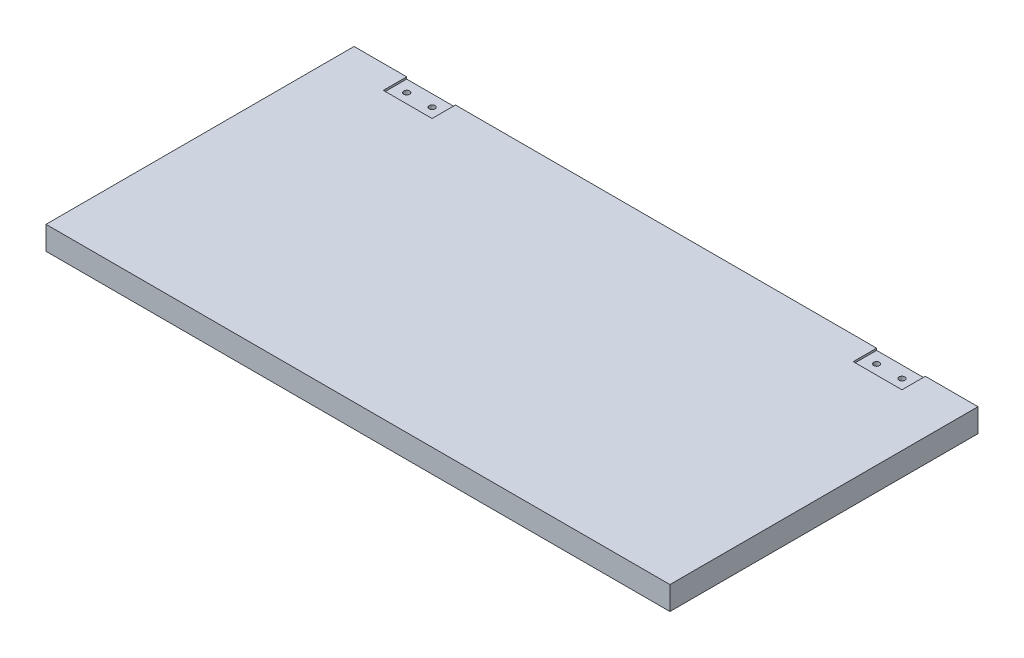
ISO-10303-21;
HEADER;
FILE_DESCRIPTION(('STEP AP214'),'2;1');
FILE_NAME('part.step','',(''),(''),'','','');
FILE_SCHEMA(('AUTOMOTIVE_DESIGN { 1 0 10303 214 1 1 1 1 }'));
ENDSEC;
DATA;
#1=APPLICATION_CONTEXT('core data for automotive mechanical design processes');
#2=APPLICATION_PROTOCOL_DEFINITION('international standard','automotive_design',2000,#1);
#3=PRODUCT_CONTEXT('',#1,'mechanical');
#4=PRODUCT('Part','Part','',(#3));
#5=PRODUCT_RELATED_PRODUCT_CATEGORY('part','',(#4));
#6=PRODUCT_DEFINITION_FORMATION('','',#4);
#7=PRODUCT_DEFINITION_CONTEXT('part definition',#1,'design');
#8=PRODUCT_DEFINITION('design','',#6,#7);
#9=PRODUCT_DEFINITION_SHAPE('','',#8);
#10=(LENGTH_UNIT() NAMED_UNIT(*) SI_UNIT(.MILLI.,.METRE.));
#11=(NAMED_UNIT(*) PLANE_ANGLE_UNIT() SI_UNIT($,.RADIAN.));
#12=(NAMED_UNIT(*) SI_UNIT($,.STERADIAN.) SOLID_ANGLE_UNIT());
#13=UNCERTAINTY_MEASURE_WITH_UNIT(LENGTH_MEASURE(1.E-05),#10,'distance_accuracy_value','');
#14=(GEOMETRIC_REPRESENTATION_CONTEXT(3) GLOBAL_UNCERTAINTY_ASSIGNED_CONTEXT((#13)) GLOBAL_UNIT_ASSIGNED_CONTEXT((#10,
#11,#12)) REPRESENTATION_CONTEXT('',''));
#15=CARTESIAN_POINT('',(0.,0.,0.));
#16=DIRECTION('',(0.,0.,1.));
#17=DIRECTION('',(1.,0.,0.));
#18=AXIS2_PLACEMENT_3D('',#15,#16,#17);
#19=CARTESIAN_POINT('',(0.,12.,0.));
#20=DIRECTION('',(1.,0.,0.));
#21=DIRECTION('',(0.,0.,-1.));
#22=AXIS2_PLACEMENT_3D('',#19,#20,#21);
#23=PLANE('',#22);
#24=DIRECTION('',(0.,0.,1.));
#25=VECTOR('',#24,1.);
#26=CARTESIAN_POINT('',(0.,0.,0.));
#27=LINE('',#26,#25);
#28=CARTESIAN_POINT('',(0.,0.,-158.));
#29=VERTEX_POINT('',#28);
#30=CARTESIAN_POINT('',(0.,0.,0.));
#31=VERTEX_POINT('',#30);
#32=EDGE_CURVE('E174',#29,#31,#27,.T.);
#33=ORIENTED_EDGE('',*,*,#32,.T.);
#34=DIRECTION('',(0.,-1.,0.));
#35=VECTOR('',#34,1.);
#36=CARTESIAN_POINT('',(0.,12.,0.));
#37=LINE('',#36,#35);
#38=CARTESIAN_POINT('',(0.,12.,0.));
#39=VERTEX_POINT('',#38);
#40=EDGE_CURVE('E11',#39,#31,#37,.T.);
#41=ORIENTED_EDGE('',*,*,#40,.F.);
#42=DIRECTION('',(0.,0.,1.));
#43=VECTOR('',#42,1.);
#44=CARTESIAN_POINT('',(0.,12.,0.));
#45=LINE('',#44,#43);
#46=CARTESIAN_POINT('',(0.,12.,-158.));
#47=VERTEX_POINT('',#46);
#48=EDGE_CURVE('E180',#47,#39,#45,.T.);
#49=ORIENTED_EDGE('',*,*,#48,.F.);
#50=DIRECTION('',(0.,-1.,0.));
#51=VECTOR('',#50,1.);
#52=CARTESIAN_POINT('',(0.,12.,-158.));
#53=LINE('',#52,#51);
#54=EDGE_CURVE('E192',#47,#29,#53,.T.);
#55=ORIENTED_EDGE('',*,*,#54,.T.);
#56=EDGE_LOOP('',(#33,#41,#49,#55));
#57=FACE_BOUND('',#56,.T.);
#58=ADVANCED_FACE('F32',(#57),#23,.F.);
#59=CARTESIAN_POINT('',(0.,12.,0.));
#60=DIRECTION('',(0.,0.,-1.));
#61=DIRECTION('',(-1.,0.,0.));
#62=AXIS2_PLACEMENT_3D('',#59,#60,#61);
#63=PLANE('',#62);
#64=DIRECTION('',(1.,0.,0.));
#65=VECTOR('',#64,1.);
#66=CARTESIAN_POINT('',(0.,0.,0.));
#67=LINE('',#66,#65);
#68=CARTESIAN_POINT('',(320.,0.,0.));
#69=VERTEX_POINT('',#68);
#70=EDGE_CURVE('E195',#31,#69,#67,.T.);
#71=ORIENTED_EDGE('',*,*,#70,.T.);
#72=DIRECTION('',(0.,-1.,0.));
#73=VECTOR('',#72,1.);
#74=CARTESIAN_POINT('',(320.,12.,0.));
#75=LINE('',#74,#73);
#76=CARTESIAN_POINT('',(320.,12.,0.));
#77=VERTEX_POINT('',#76);
#78=EDGE_CURVE('E40',#77,#69,#75,.T.);
#79=ORIENTED_EDGE('',*,*,#78,.F.);
#80=DIRECTION('',(1.,0.,0.));
#81=VECTOR('',#80,1.);
#82=CARTESIAN_POINT('',(0.,12.,0.));
#83=LINE('',#82,#81);
#84=EDGE_CURVE('E183',#39,#77,#83,.T.);
#85=ORIENTED_EDGE('',*,*,#84,.F.);
#86=ORIENTED_EDGE('',*,*,#40,.T.);
#87=EDGE_LOOP('',(#71,#79,#85,#86));
#88=FACE_BOUND('',#87,.T.);
#89=ADVANCED_FACE('F280',(#88),#63,.F.);
#90=CARTESIAN_POINT('',(320.,12.,0.));
#91=DIRECTION('',(-1.,0.,0.));
#92=DIRECTION('',(0.,0.,1.));
#93=AXIS2_PLACEMENT_3D('',#90,#91,#92);
#94=PLANE('',#93);
#95=DIRECTION('',(0.,0.,-1.));
#96=VECTOR('',#95,1.);
#97=CARTESIAN_POINT('',(320.,0.,0.));
#98=LINE('',#97,#96);
#99=CARTESIAN_POINT('',(320.,0.,-158.));
#100=VERTEX_POINT('',#99);
#101=EDGE_CURVE('E197',#69,#100,#98,.T.);
#102=ORIENTED_EDGE('',*,*,#101,.T.);
#103=DIRECTION('',(0.,-1.,0.));
#104=VECTOR('',#103,1.);
#105=CARTESIAN_POINT('',(320.,12.,-158.));
#106=LINE('',#105,#104);
#107=CARTESIAN_POINT('',(320.,12.,-158.));
#108=VERTEX_POINT('',#107);
#109=EDGE_CURVE('E202',#108,#100,#106,.T.);
#110=ORIENTED_EDGE('',*,*,#109,.F.);
#111=DIRECTION('',(0.,0.,-1.));
#112=VECTOR('',#111,1.);
#113=CARTESIAN_POINT('',(320.,12.,0.));
#114=LINE('',#113,#112);
#115=EDGE_CURVE('E186',#77,#108,#114,.T.);
#116=ORIENTED_EDGE('',*,*,#115,.F.);
#117=ORIENTED_EDGE('',*,*,#78,.T.);
#118=EDGE_LOOP('',(#102,#110,#116,#117));
#119=FACE_BOUND('',#118,.T.);
#120=ADVANCED_FACE('F284',(#119),#94,.F.);
#121=CARTESIAN_POINT('',(0.,12.,-158.));
#122=DIRECTION('',(0.,0.,1.));
#123=DIRECTION('',(1.,0.,0.));
#124=AXIS2_PLACEMENT_3D('',#121,#122,#123);
#125=PLANE('',#124);
#126=DIRECTION('',(-1.,0.,0.));
#127=VECTOR('',#126,1.);
#128=CARTESIAN_POINT('',(0.,11.,-157.999999999997));
#129=LINE('',#128,#127);
#130=CARTESIAN_POINT('',(293.,11.,-157.999999999997));
#131=VERTEX_POINT('',#130);
#132=CARTESIAN_POINT('',(268.,11.,-157.999999999997));
#133=VERTEX_POINT('',#132);
#134=EDGE_CURVE('E130',#131,#133,#129,.T.);
#135=ORIENTED_EDGE('',*,*,#134,.F.);
#136=DIRECTION('',(0.,1.,0.));
#137=VECTOR('',#136,1.);
#138=CARTESIAN_POINT('',(293.,11.,-157.999999999997));
#139=LINE('',#138,#137);
#140=CARTESIAN_POINT('',(293.,12.,-157.999999999997));
#141=VERTEX_POINT('',#140);
#142=EDGE_CURVE('E167',#131,#141,#139,.T.);
#143=ORIENTED_EDGE('',*,*,#142,.T.);
#144=DIRECTION('',(-1.,0.,0.));
#145=VECTOR('',#144,1.);
#146=CARTESIAN_POINT('',(0.,12.,-158.));
#147=LINE('',#146,#145);
#148=EDGE_CURVE('E189',#108,#141,#147,.T.);
#149=ORIENTED_EDGE('',*,*,#148,.F.);
#150=ORIENTED_EDGE('',*,*,#109,.T.);
#151=DIRECTION('',(-1.,0.,0.));
#152=VECTOR('',#151,1.);
#153=CARTESIAN_POINT('',(0.,0.,-158.));
#154=LINE('',#153,#152);
#155=EDGE_CURVE('E184',#100,#29,#154,.T.);
#156=ORIENTED_EDGE('',*,*,#155,.T.);
#157=ORIENTED_EDGE('',*,*,#54,.F.);
#158=CARTESIAN_POINT('',(27.,12.,-158.));
#159=VERTEX_POINT('',#158);
#160=EDGE_CURVE('E188',#159,#47,#147,.T.);
#161=ORIENTED_EDGE('',*,*,#160,.F.);
#162=DIRECTION('',(0.,1.,0.));
#163=VECTOR('',#162,1.);
#164=CARTESIAN_POINT('',(27.,11.,-157.999999999997));
#165=LINE('',#164,#163);
#166=CARTESIAN_POINT('',(27.,11.,-157.999999999997));
#167=VERTEX_POINT('',#166);
#168=EDGE_CURVE('E56',#167,#159,#165,.T.);
#169=ORIENTED_EDGE('',*,*,#168,.F.);
#170=DIRECTION('',(-1.,0.,0.));
#171=VECTOR('',#170,1.);
#172=CARTESIAN_POINT('',(-1.75415237890771E-13,11.,-157.999999999997));
#173=LINE('',#172,#171);
#174=CARTESIAN_POINT('',(52.,11.,-157.999999999997));
#175=VERTEX_POINT('',#174);
#176=EDGE_CURVE('E151',#175,#167,#173,.T.);
#177=ORIENTED_EDGE('',*,*,#176,.F.);
#178=DIRECTION('',(0.,1.,0.));
#179=VECTOR('',#178,1.);
#180=CARTESIAN_POINT('',(52.,11.,-157.999999999997));
#181=LINE('',#180,#179);
#182=CARTESIAN_POINT('',(52.,12.,-157.999999999997));
#183=VERTEX_POINT('',#182);
#184=EDGE_CURVE('E172',#175,#183,#181,.T.);
#185=ORIENTED_EDGE('',*,*,#184,.T.);
#186=CARTESIAN_POINT('',(268.,12.,-158.));
#187=VERTEX_POINT('',#186);
#188=EDGE_CURVE('E144',#187,#183,#147,.T.);
#189=ORIENTED_EDGE('',*,*,#188,.F.);
#190=DIRECTION('',(0.,1.,0.));
#191=VECTOR('',#190,1.);
#192=CARTESIAN_POINT('',(268.,11.,-157.999999999997));
#193=LINE('',#192,#191);
#194=EDGE_CURVE('E48',#133,#187,#193,.T.);
#195=ORIENTED_EDGE('',*,*,#194,.F.);
#196=EDGE_LOOP('',(#135,#143,#149,#150,#156,#157,#161,#169,#177,#185,#189,#195));
#197=FACE_BOUND('',#196,.T.);
#198=ADVANCED_FACE('F142',(#197),#125,.F.);
#199=CARTESIAN_POINT('',(0.,12.,0.));
#200=DIRECTION('',(0.,-1.,0.));
#201=DIRECTION('',(0.,0.,-1.));
#202=AXIS2_PLACEMENT_3D('',#199,#200,#201);
#203=PLANE('',#202);
#204=ORIENTED_EDGE('',*,*,#148,.T.);
#205=DIRECTION('',(0.,0.,-1.));
#206=VECTOR('',#205,1.);
#207=CARTESIAN_POINT('',(293.,12.,0.));
#208=LINE('',#207,#206);
#209=CARTESIAN_POINT('',(293.,12.,-145.999999999997));
#210=VERTEX_POINT('',#209);
#211=EDGE_CURVE('E139',#210,#141,#208,.T.);
#212=ORIENTED_EDGE('',*,*,#211,.F.);
#213=DIRECTION('',(1.,0.,0.));
#214=VECTOR('',#213,1.);
#215=CARTESIAN_POINT('',(0.,12.,-145.999999999997));
#216=LINE('',#215,#214);
#217=CARTESIAN_POINT('',(268.,12.,-145.999999999997));
#218=VERTEX_POINT('',#217);
#219=EDGE_CURVE('E232',#218,#210,#216,.T.);
#220=ORIENTED_EDGE('',*,*,#219,.F.);
#221=DIRECTION('',(0.,0.,1.));
#222=VECTOR('',#221,1.);
#223=CARTESIAN_POINT('',(268.,12.,0.));
#224=LINE('',#223,#222);
#225=EDGE_CURVE('E210',#187,#218,#224,.T.);
#226=ORIENTED_EDGE('',*,*,#225,.F.);
#227=ORIENTED_EDGE('',*,*,#188,.T.);
#228=DIRECTION('',(0.,0.,-1.));
#229=VECTOR('',#228,1.);
#230=CARTESIAN_POINT('',(52.,12.,0.));
#231=LINE('',#230,#229);
#232=CARTESIAN_POINT('',(52.,12.,-145.999999999997));
#233=VERTEX_POINT('',#232);
#234=EDGE_CURVE('E155',#233,#183,#231,.T.);
#235=ORIENTED_EDGE('',*,*,#234,.F.);
#236=DIRECTION('',(1.,0.,0.));
#237=VECTOR('',#236,1.);
#238=CARTESIAN_POINT('',(0.,12.,-145.999999999997));
#239=LINE('',#238,#237);
#240=CARTESIAN_POINT('',(27.,12.,-145.999999999997));
#241=VERTEX_POINT('',#240);
#242=EDGE_CURVE('E166',#241,#233,#239,.T.);
#243=ORIENTED_EDGE('',*,*,#242,.F.);
#244=DIRECTION('',(0.,0.,1.));
#245=VECTOR('',#244,1.);
#246=CARTESIAN_POINT('',(27.,12.,0.));
#247=LINE('',#246,#245);
#248=EDGE_CURVE('E164',#159,#241,#247,.T.);
#249=ORIENTED_EDGE('',*,*,#248,.F.);
#250=ORIENTED_EDGE('',*,*,#160,.T.);
#251=ORIENTED_EDGE('',*,*,#48,.T.);
#252=ORIENTED_EDGE('',*,*,#84,.T.);
#253=ORIENTED_EDGE('',*,*,#115,.T.);
#254=EDGE_LOOP('',(#204,#212,#220,#226,#227,#235,#243,#249,#250,#251,#252,#253));
#255=FACE_BOUND('',#254,.T.);
#256=ADVANCED_FACE('F243',(#255),#203,.F.);
#257=CARTESIAN_POINT('',(0.,0.,0.));
#258=DIRECTION('',(0.,-1.,0.));
#259=DIRECTION('',(0.,0.,-1.));
#260=AXIS2_PLACEMENT_3D('',#257,#258,#259);
#261=PLANE('',#260);
#262=ORIENTED_EDGE('',*,*,#32,.F.);
#263=ORIENTED_EDGE('',*,*,#155,.F.);
#264=ORIENTED_EDGE('',*,*,#101,.F.);
#265=ORIENTED_EDGE('',*,*,#70,.F.);
#266=EDGE_LOOP('',(#262,#263,#264,#265));
#267=FACE_BOUND('',#266,.T.);
#268=ADVANCED_FACE('F253',(#267),#261,.T.);
#269=CARTESIAN_POINT('',(52.,11.,0.));
#270=DIRECTION('',(1.,0.,0.));
#271=DIRECTION('',(0.,0.,-1.));
#272=AXIS2_PLACEMENT_3D('',#269,#270,#271);
#273=PLANE('',#272);
#274=ORIENTED_EDGE('',*,*,#234,.T.);
#275=ORIENTED_EDGE('',*,*,#184,.F.);
#276=DIRECTION('',(0.,0.,-1.));
#277=VECTOR('',#276,1.);
#278=CARTESIAN_POINT('',(52.,11.,0.));
#279=LINE('',#278,#277);
#280=CARTESIAN_POINT('',(52.,11.,-145.999999999997));
#281=VERTEX_POINT('',#280);
#282=EDGE_CURVE('E161',#281,#175,#279,.T.);
#283=ORIENTED_EDGE('',*,*,#282,.F.);
#284=DIRECTION('',(0.,1.,0.));
#285=VECTOR('',#284,1.);
#286=CARTESIAN_POINT('',(52.,11.,-145.999999999997));
#287=LINE('',#286,#285);
#288=EDGE_CURVE('E175',#281,#233,#287,.T.);
#289=ORIENTED_EDGE('',*,*,#288,.T.);
#290=EDGE_LOOP('',(#274,#275,#283,#289));
#291=FACE_BOUND('',#290,.T.);
#292=ADVANCED_FACE('F262',(#291),#273,.F.);
#293=CARTESIAN_POINT('',(0.,11.,-145.999999999997));
#294=DIRECTION('',(0.,0.,1.));
#295=DIRECTION('',(1.,0.,0.));
#296=AXIS2_PLACEMENT_3D('',#293,#294,#295);
#297=PLANE('',#296);
#298=ORIENTED_EDGE('',*,*,#242,.T.);
#299=ORIENTED_EDGE('',*,*,#288,.F.);
#300=DIRECTION('',(1.,0.,0.));
#301=VECTOR('',#300,1.);
#302=CARTESIAN_POINT('',(0.,11.,-145.999999999997));
#303=LINE('',#302,#301);
#304=CARTESIAN_POINT('',(27.,11.,-145.999999999997));
#305=VERTEX_POINT('',#304);
#306=EDGE_CURVE('E158',#305,#281,#303,.T.);
#307=ORIENTED_EDGE('',*,*,#306,.F.);
#308=DIRECTION('',(0.,1.,0.));
#309=VECTOR('',#308,1.);
#310=CARTESIAN_POINT('',(27.,11.,-145.999999999997));
#311=LINE('',#310,#309);
#312=EDGE_CURVE('E177',#305,#241,#311,.T.);
#313=ORIENTED_EDGE('',*,*,#312,.T.);
#314=EDGE_LOOP('',(#298,#299,#307,#313));
#315=FACE_BOUND('',#314,.T.);
#316=ADVANCED_FACE('F268',(#315),#297,.F.);
#317=CARTESIAN_POINT('',(27.,11.,0.));
#318=DIRECTION('',(-1.,0.,0.));
#319=DIRECTION('',(0.,0.,1.));
#320=AXIS2_PLACEMENT_3D('',#317,#318,#319);
#321=PLANE('',#320);
#322=ORIENTED_EDGE('',*,*,#248,.T.);
#323=ORIENTED_EDGE('',*,*,#312,.F.);
#324=DIRECTION('',(0.,0.,1.));
#325=VECTOR('',#324,1.);
#326=CARTESIAN_POINT('',(27.,11.,0.));
#327=LINE('',#326,#325);
#328=EDGE_CURVE('E154',#167,#305,#327,.T.);
#329=ORIENTED_EDGE('',*,*,#328,.F.);
#330=ORIENTED_EDGE('',*,*,#168,.T.);
#331=EDGE_LOOP('',(#322,#323,#329,#330));
#332=FACE_BOUND('',#331,.T.);
#333=ADVANCED_FACE('F269',(#332),#321,.F.);
#334=CARTESIAN_POINT('',(0.,11.,0.));
#335=DIRECTION('',(0.,1.,0.));
#336=DIRECTION('',(0.,0.,1.));
#337=AXIS2_PLACEMENT_3D('',#334,#335,#336);
#338=PLANE('',#337);
#339=CARTESIAN_POINT('',(46.,11.,-152.));
#340=DIRECTION('',(0.,1.,0.));
#341=DIRECTION('',(0.,0.,1.));
#342=AXIS2_PLACEMENT_3D('',#339,#340,#341);
#343=CIRCLE('',#342,1.5);
#344=CARTESIAN_POINT('',(46.,11.,-150.5));
#345=VERTEX_POINT('',#344);
#346=EDGE_CURVE('E35',#345,#345,#343,.F.);
#347=ORIENTED_EDGE('',*,*,#346,.T.);
#348=EDGE_LOOP('',(#347));
#349=FACE_BOUND('',#348,.T.);
#350=CARTESIAN_POINT('',(33.,11.,-152.));
#351=DIRECTION('',(0.,1.,0.));
#352=DIRECTION('',(0.,0.,1.));
#353=AXIS2_PLACEMENT_3D('',#350,#351,#352);
#354=CIRCLE('',#353,1.5);
#355=CARTESIAN_POINT('',(33.,11.,-150.5));
#356=VERTEX_POINT('',#355);
#357=EDGE_CURVE('E207',#356,#356,#354,.F.);
#358=ORIENTED_EDGE('',*,*,#357,.T.);
#359=EDGE_LOOP('',(#358));
#360=FACE_BOUND('',#359,.T.);
#361=ORIENTED_EDGE('',*,*,#176,.T.);
#362=ORIENTED_EDGE('',*,*,#328,.T.);
#363=ORIENTED_EDGE('',*,*,#306,.T.);
#364=ORIENTED_EDGE('',*,*,#282,.T.);
#365=EDGE_LOOP('',(#361,#362,#363,#364));
#366=FACE_BOUND('',#365,.T.);
#367=ADVANCED_FACE('F265',(#349,#360,#366),#338,.T.);
#368=CARTESIAN_POINT('',(293.,11.,0.));
#369=DIRECTION('',(1.,0.,0.));
#370=DIRECTION('',(0.,0.,-1.));
#371=AXIS2_PLACEMENT_3D('',#368,#369,#370);
#372=PLANE('',#371);
#373=ORIENTED_EDGE('',*,*,#211,.T.);
#374=ORIENTED_EDGE('',*,*,#142,.F.);
#375=DIRECTION('',(0.,0.,-1.));
#376=VECTOR('',#375,1.);
#377=CARTESIAN_POINT('',(293.,11.,0.));
#378=LINE('',#377,#376);
#379=CARTESIAN_POINT('',(293.,11.,-145.999999999997));
#380=VERTEX_POINT('',#379);
#381=EDGE_CURVE('E136',#380,#131,#378,.T.);
#382=ORIENTED_EDGE('',*,*,#381,.F.);
#383=DIRECTION('',(0.,1.,0.));
#384=VECTOR('',#383,1.);
#385=CARTESIAN_POINT('',(293.,11.,-145.999999999997));
#386=LINE('',#385,#384);
#387=EDGE_CURVE('E146',#380,#210,#386,.T.);
#388=ORIENTED_EDGE('',*,*,#387,.T.);
#389=EDGE_LOOP('',(#373,#374,#382,#388));
#390=FACE_BOUND('',#389,.T.);
#391=ADVANCED_FACE('F237',(#390),#372,.F.);
#392=CARTESIAN_POINT('',(0.,11.,-145.999999999997));
#393=DIRECTION('',(0.,0.,1.));
#394=DIRECTION('',(1.,0.,0.));
#395=AXIS2_PLACEMENT_3D('',#392,#393,#394);
#396=PLANE('',#395);
#397=ORIENTED_EDGE('',*,*,#219,.T.);
#398=ORIENTED_EDGE('',*,*,#387,.F.);
#399=DIRECTION('',(1.,0.,0.));
#400=VECTOR('',#399,1.);
#401=CARTESIAN_POINT('',(0.,11.,-145.999999999997));
#402=LINE('',#401,#400);
#403=CARTESIAN_POINT('',(268.,11.,-145.999999999997));
#404=VERTEX_POINT('',#403);
#405=EDGE_CURVE('E129',#404,#380,#402,.T.);
#406=ORIENTED_EDGE('',*,*,#405,.F.);
#407=DIRECTION('',(0.,1.,0.));
#408=VECTOR('',#407,1.);
#409=CARTESIAN_POINT('',(268.,11.,-145.999999999997));
#410=LINE('',#409,#408);
#411=EDGE_CURVE('E125',#404,#218,#410,.T.);
#412=ORIENTED_EDGE('',*,*,#411,.T.);
#413=EDGE_LOOP('',(#397,#398,#406,#412));
#414=FACE_BOUND('',#413,.T.);
#415=ADVANCED_FACE('F241',(#414),#396,.F.);
#416=CARTESIAN_POINT('',(268.,11.,0.));
#417=DIRECTION('',(-1.,0.,0.));
#418=DIRECTION('',(0.,0.,1.));
#419=AXIS2_PLACEMENT_3D('',#416,#417,#418);
#420=PLANE('',#419);
#421=ORIENTED_EDGE('',*,*,#225,.T.);
#422=ORIENTED_EDGE('',*,*,#411,.F.);
#423=DIRECTION('',(0.,0.,1.));
#424=VECTOR('',#423,1.);
#425=CARTESIAN_POINT('',(268.,11.,0.));
#426=LINE('',#425,#424);
#427=EDGE_CURVE('E122',#133,#404,#426,.T.);
#428=ORIENTED_EDGE('',*,*,#427,.F.);
#429=ORIENTED_EDGE('',*,*,#194,.T.);
#430=EDGE_LOOP('',(#421,#422,#428,#429));
#431=FACE_BOUND('',#430,.T.);
#432=ADVANCED_FACE('F124',(#431),#420,.F.);
#433=CARTESIAN_POINT('',(0.,11.,0.));
#434=DIRECTION('',(0.,1.,0.));
#435=DIRECTION('',(0.,0.,1.));
#436=AXIS2_PLACEMENT_3D('',#433,#434,#435);
#437=PLANE('',#436);
#438=CARTESIAN_POINT('',(274.,11.,-152.));
#439=DIRECTION('',(0.,1.,0.));
#440=DIRECTION('',(0.,0.,1.));
#441=AXIS2_PLACEMENT_3D('',#438,#439,#440);
#442=CIRCLE('',#441,1.50000000000002);
#443=CARTESIAN_POINT('',(274.,11.,-150.5));
#444=VERTEX_POINT('',#443);
#445=EDGE_CURVE('E214',#444,#444,#442,.F.);
#446=ORIENTED_EDGE('',*,*,#445,.T.);
#447=EDGE_LOOP('',(#446));
#448=FACE_BOUND('',#447,.T.);
#449=CARTESIAN_POINT('',(287.,11.,-152.));
#450=DIRECTION('',(0.,1.,0.));
#451=DIRECTION('',(0.,0.,1.));
#452=AXIS2_PLACEMENT_3D('',#449,#450,#451);
#453=CIRCLE('',#452,1.50000000000002);
#454=CARTESIAN_POINT('',(287.,11.,-150.5));
#455=VERTEX_POINT('',#454);
#456=EDGE_CURVE('E212',#455,#455,#453,.F.);
#457=ORIENTED_EDGE('',*,*,#456,.T.);
#458=EDGE_LOOP('',(#457));
#459=FACE_BOUND('',#458,.T.);
#460=ORIENTED_EDGE('',*,*,#134,.T.);
#461=ORIENTED_EDGE('',*,*,#427,.T.);
#462=ORIENTED_EDGE('',*,*,#405,.T.);
#463=ORIENTED_EDGE('',*,*,#381,.T.);
#464=EDGE_LOOP('',(#460,#461,#462,#463));
#465=FACE_BOUND('',#464,.T.);
#466=ADVANCED_FACE('F134',(#448,#459,#465),#437,.T.);
#467=CARTESIAN_POINT('',(33.,12.,-152.));
#468=DIRECTION('',(0.,-1.,0.));
#469=DIRECTION('',(0.,0.,-1.));
#470=AXIS2_PLACEMENT_3D('',#467,#468,#469);
#471=CYLINDRICAL_SURFACE('',#470,1.5);
#472=ORIENTED_EDGE('',*,*,#357,.F.);
#473=EDGE_LOOP('',(#472));
#474=FACE_BOUND('',#473,.T.);
#475=CARTESIAN_POINT('',(33.,3.,-152.));
#476=DIRECTION('',(0.,1.,0.));
#477=DIRECTION('',(0.,0.,1.));
#478=AXIS2_PLACEMENT_3D('',#475,#476,#477);
#479=CIRCLE('',#478,1.5);
#480=CARTESIAN_POINT('',(33.,3.,-150.5));
#481=VERTEX_POINT('',#480);
#482=EDGE_CURVE('E211',#481,#481,#479,.T.);
#483=ORIENTED_EDGE('',*,*,#482,.F.);
#484=EDGE_LOOP('',(#483));
#485=FACE_BOUND('',#484,.T.);
#486=ADVANCED_FACE('F357',(#474,#485),#471,.F.);
#487=CARTESIAN_POINT('',(33.,3.,-152.));
#488=DIRECTION('',(0.,1.,0.));
#489=DIRECTION('',(0.,0.,1.));
#490=AXIS2_PLACEMENT_3D('',#487,#488,#489);
#491=PLANE('',#490);
#492=ORIENTED_EDGE('',*,*,#482,.T.);
#493=EDGE_LOOP('',(#492));
#494=FACE_BOUND('',#493,.T.);
#495=ADVANCED_FACE('F366',(#494),#491,.T.);
#496=CARTESIAN_POINT('',(287.,12.,-152.));
#497=DIRECTION('',(0.,-1.,0.));
#498=DIRECTION('',(0.,0.,-1.));
#499=AXIS2_PLACEMENT_3D('',#496,#497,#498);
#500=CYLINDRICAL_SURFACE('',#499,1.50000000000002);
#501=ORIENTED_EDGE('',*,*,#456,.F.);
#502=EDGE_LOOP('',(#501));
#503=FACE_BOUND('',#502,.T.);
#504=CARTESIAN_POINT('',(287.,3.,-152.));
#505=DIRECTION('',(0.,1.,0.));
#506=DIRECTION('',(0.,0.,1.));
#507=AXIS2_PLACEMENT_3D('',#504,#505,#506);
#508=CIRCLE('',#507,1.50000000000002);
#509=CARTESIAN_POINT('',(287.,3.,-150.5));
#510=VERTEX_POINT('',#509);
#511=EDGE_CURVE('E227',#510,#510,#508,.T.);
#512=ORIENTED_EDGE('',*,*,#511,.F.);
#513=EDGE_LOOP('',(#512));
#514=FACE_BOUND('',#513,.T.);
#515=ADVANCED_FACE('F376',(#503,#514),#500,.F.);
#516=CARTESIAN_POINT('',(287.,3.,-152.));
#517=DIRECTION('',(0.,1.,0.));
#518=DIRECTION('',(0.,0.,1.));
#519=AXIS2_PLACEMENT_3D('',#516,#517,#518);
#520=PLANE('',#519);
#521=ORIENTED_EDGE('',*,*,#511,.T.);
#522=EDGE_LOOP('',(#521));
#523=FACE_BOUND('',#522,.T.);
#524=ADVANCED_FACE('F385',(#523),#520,.T.);
#525=CARTESIAN_POINT('',(274.,12.,-152.));
#526=DIRECTION('',(0.,-1.,0.));
#527=DIRECTION('',(0.,0.,-1.));
#528=AXIS2_PLACEMENT_3D('',#525,#526,#527);
#529=CYLINDRICAL_SURFACE('',#528,1.50000000000002);
#530=ORIENTED_EDGE('',*,*,#445,.F.);
#531=EDGE_LOOP('',(#530));
#532=FACE_BOUND('',#531,.T.);
#533=CARTESIAN_POINT('',(274.,3.,-152.));
#534=DIRECTION('',(0.,1.,0.));
#535=DIRECTION('',(0.,0.,1.));
#536=AXIS2_PLACEMENT_3D('',#533,#534,#535);
#537=CIRCLE('',#536,1.50000000000002);
#538=CARTESIAN_POINT('',(274.,3.,-150.5));
#539=VERTEX_POINT('',#538);
#540=EDGE_CURVE('E442',#539,#539,#537,.T.);
#541=ORIENTED_EDGE('',*,*,#540,.F.);
#542=EDGE_LOOP('',(#541));
#543=FACE_BOUND('',#542,.T.);
#544=ADVANCED_FACE('F395',(#532,#543),#529,.F.);
#545=CARTESIAN_POINT('',(274.,3.,-152.));
#546=DIRECTION('',(0.,1.,0.));
#547=DIRECTION('',(0.,0.,1.));
#548=AXIS2_PLACEMENT_3D('',#545,#546,#547);
#549=PLANE('',#548);
#550=ORIENTED_EDGE('',*,*,#540,.T.);
#551=EDGE_LOOP('',(#550));
#552=FACE_BOUND('',#551,.T.);
#553=ADVANCED_FACE('F405',(#552),#549,.T.);
#554=CARTESIAN_POINT('',(46.,12.,-152.));
#555=DIRECTION('',(0.,-1.,0.));
#556=DIRECTION('',(0.,0.,-1.));
#557=AXIS2_PLACEMENT_3D('',#554,#555,#556);
#558=CYLINDRICAL_SURFACE('',#557,1.5);
#559=ORIENTED_EDGE('',*,*,#346,.F.);
#560=EDGE_LOOP('',(#559));
#561=FACE_BOUND('',#560,.T.);
#562=CARTESIAN_POINT('',(46.,3.,-152.));
#563=DIRECTION('',(0.,1.,0.));
#564=DIRECTION('',(0.,0.,1.));
#565=AXIS2_PLACEMENT_3D('',#562,#563,#564);
#566=CIRCLE('',#565,1.5);
#567=CARTESIAN_POINT('',(46.,3.,-150.5));
#568=VERTEX_POINT('',#567);
#569=EDGE_CURVE('E215',#568,#568,#566,.T.);
#570=ORIENTED_EDGE('',*,*,#569,.F.);
#571=EDGE_LOOP('',(#570));
#572=FACE_BOUND('',#571,.T.);
#573=ADVANCED_FACE('F415',(#561,#572),#558,.F.);
#574=CARTESIAN_POINT('',(46.,3.,-152.));
#575=DIRECTION('',(0.,1.,0.));
#576=DIRECTION('',(0.,0.,1.));
#577=AXIS2_PLACEMENT_3D('',#574,#575,#576);
#578=PLANE('',#577);
#579=ORIENTED_EDGE('',*,*,#569,.T.);
#580=EDGE_LOOP('',(#579));
#581=FACE_BOUND('',#580,.T.);
#582=ADVANCED_FACE('F425',(#581),#578,.T.);
#583=CLOSED_SHELL('',(#58,#89,#120,#198,#256,#268,#292,#316,#333,#367,#391,#415,#432,#466,#486,
#495,#515,#524,#544,#553,#573,#582));
#584=MANIFOLD_SOLID_BREP('B2',#583);
#585=ADVANCED_BREP_SHAPE_REPRESENTATION('',(#18,#584),#14);
#586=SHAPE_DEFINITION_REPRESENTATION(#9,#585);
ENDSEC;
END-ISO-10303-21;
